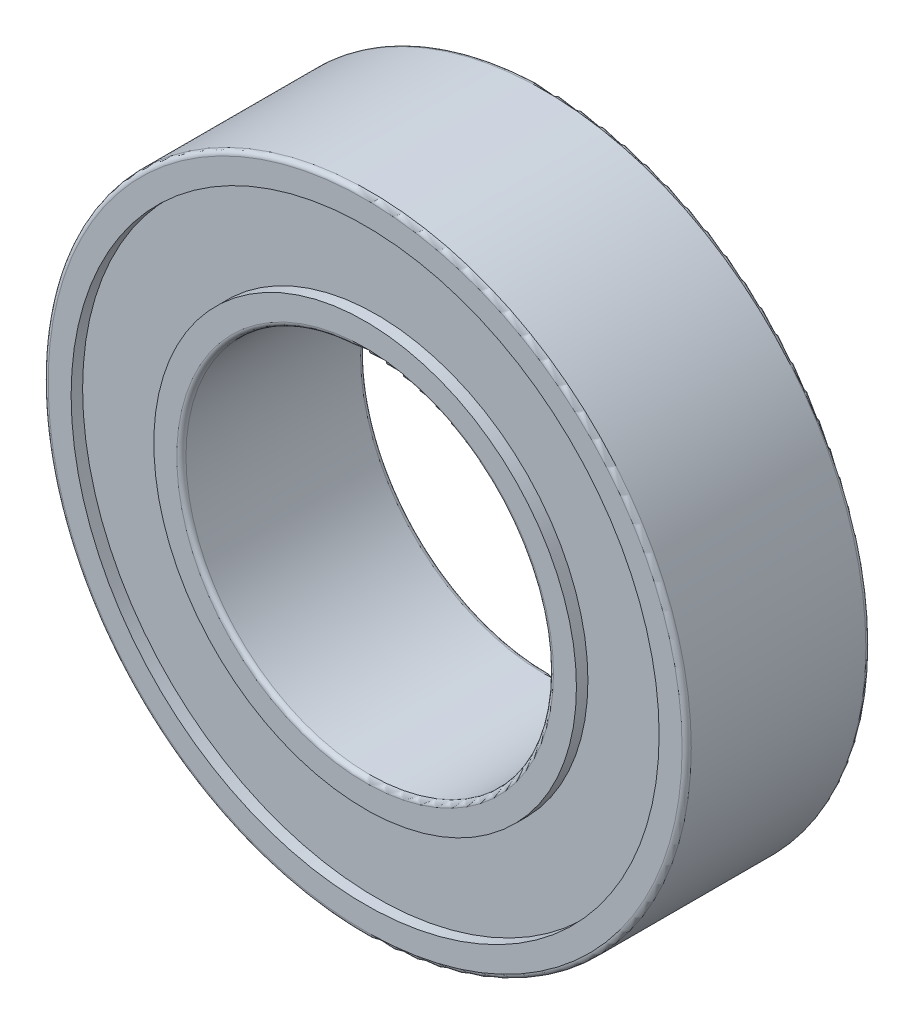
ISO-10303-21;
HEADER;
FILE_DESCRIPTION(('STEP AP214'),'2;1');
FILE_NAME('part.step','',(''),(''),'','','');
FILE_SCHEMA(('AUTOMOTIVE_DESIGN { 1 0 10303 214 1 1 1 1 }'));
ENDSEC;
DATA;
#1=APPLICATION_CONTEXT('core data for automotive mechanical design processes');
#2=APPLICATION_PROTOCOL_DEFINITION('international standard','automotive_design',2000,#1);
#3=PRODUCT_CONTEXT('',#1,'mechanical');
#4=PRODUCT('Part','Part','',(#3));
#5=PRODUCT_RELATED_PRODUCT_CATEGORY('part','',(#4));
#6=PRODUCT_DEFINITION_FORMATION('','',#4);
#7=PRODUCT_DEFINITION_CONTEXT('part definition',#1,'design');
#8=PRODUCT_DEFINITION('design','',#6,#7);
#9=PRODUCT_DEFINITION_SHAPE('','',#8);
#10=(LENGTH_UNIT() NAMED_UNIT(*) SI_UNIT(.MILLI.,.METRE.));
#11=(NAMED_UNIT(*) PLANE_ANGLE_UNIT() SI_UNIT($,.RADIAN.));
#12=(NAMED_UNIT(*) SI_UNIT($,.STERADIAN.) SOLID_ANGLE_UNIT());
#13=UNCERTAINTY_MEASURE_WITH_UNIT(LENGTH_MEASURE(1.E-05),#10,'distance_accuracy_value','');
#14=(GEOMETRIC_REPRESENTATION_CONTEXT(3) GLOBAL_UNCERTAINTY_ASSIGNED_CONTEXT((#13)) GLOBAL_UNIT_ASSIGNED_CONTEXT((#10,
#11,#12)) REPRESENTATION_CONTEXT('',''));
#15=CARTESIAN_POINT('',(0.,0.,0.));
#16=DIRECTION('',(0.,0.,1.));
#17=DIRECTION('',(1.,0.,0.));
#18=AXIS2_PLACEMENT_3D('',#15,#16,#17);
#19=CARTESIAN_POINT('',(0.,0.,0.));
#20=DIRECTION('',(0.,0.,1.));
#21=DIRECTION('',(1.,0.,0.));
#22=AXIS2_PLACEMENT_3D('',#19,#20,#21);
#23=PLANE('',#22);
#24=CARTESIAN_POINT('',(0.,0.,0.));
#25=DIRECTION('',(0.,0.,1.));
#26=DIRECTION('',(1.,0.,0.));
#27=AXIS2_PLACEMENT_3D('',#24,#25,#26);
#28=CIRCLE('',#27,4.1);
#29=CARTESIAN_POINT('',(4.1,0.,0.));
#30=VERTEX_POINT('',#29);
#31=EDGE_CURVE('E10',#30,#30,#28,.T.);
#32=ORIENTED_EDGE('',*,*,#31,.T.);
#33=EDGE_LOOP('',(#32));
#34=FACE_BOUND('',#33,.T.);
#35=CARTESIAN_POINT('',(0.,0.,0.));
#36=DIRECTION('',(0.,0.,-1.));
#37=DIRECTION('',(-1.,0.,0.));
#38=AXIS2_PLACEMENT_3D('',#35,#36,#37);
#39=CIRCLE('',#38,4.6);
#40=CARTESIAN_POINT('',(-4.6,0.,0.));
#41=VERTEX_POINT('',#40);
#42=EDGE_CURVE('E83',#41,#41,#39,.T.);
#43=ORIENTED_EDGE('',*,*,#42,.T.);
#44=EDGE_LOOP('',(#43));
#45=FACE_BOUND('',#44,.T.);
#46=ADVANCED_FACE('F32',(#34,#45),#23,.F.);
#47=CARTESIAN_POINT('',(0.,0.,4.));
#48=DIRECTION('',(0.,0.,1.));
#49=DIRECTION('',(1.,0.,0.));
#50=AXIS2_PLACEMENT_3D('',#47,#48,#49);
#51=PLANE('',#50);
#52=CARTESIAN_POINT('',(0.,0.,4.));
#53=DIRECTION('',(0.,0.,1.));
#54=DIRECTION('',(1.,0.,0.));
#55=AXIS2_PLACEMENT_3D('',#52,#53,#54);
#56=CIRCLE('',#55,4.1);
#57=CARTESIAN_POINT('',(4.1,0.,4.));
#58=VERTEX_POINT('',#57);
#59=EDGE_CURVE('E39',#58,#58,#56,.F.);
#60=ORIENTED_EDGE('',*,*,#59,.T.);
#61=EDGE_LOOP('',(#60));
#62=FACE_BOUND('',#61,.T.);
#63=CARTESIAN_POINT('',(0.,0.,4.));
#64=DIRECTION('',(0.,0.,1.));
#65=DIRECTION('',(1.,0.,0.));
#66=AXIS2_PLACEMENT_3D('',#63,#64,#65);
#67=CIRCLE('',#66,4.6);
#68=CARTESIAN_POINT('',(4.6,0.,4.));
#69=VERTEX_POINT('',#68);
#70=EDGE_CURVE('E71',#69,#69,#67,.T.);
#71=ORIENTED_EDGE('',*,*,#70,.T.);
#72=EDGE_LOOP('',(#71));
#73=FACE_BOUND('',#72,.T.);
#74=ADVANCED_FACE('F118',(#62,#73),#51,.T.);
#75=CARTESIAN_POINT('',(0.,0.,4.));
#76=DIRECTION('',(0.,0.,1.));
#77=DIRECTION('',(1.,0.,0.));
#78=AXIS2_PLACEMENT_3D('',#75,#76,#77);
#79=CIRCLE('',#78,6.9);
#80=CARTESIAN_POINT('',(6.9,0.,4.));
#81=VERTEX_POINT('',#80);
#82=EDGE_CURVE('E52',#81,#81,#79,.T.);
#83=ORIENTED_EDGE('',*,*,#82,.T.);
#84=EDGE_LOOP('',(#83));
#85=FACE_BOUND('',#84,.T.);
#86=CARTESIAN_POINT('',(0.,0.,4.));
#87=DIRECTION('',(0.,0.,1.));
#88=DIRECTION('',(1.,0.,0.));
#89=AXIS2_PLACEMENT_3D('',#86,#87,#88);
#90=CIRCLE('',#89,6.4);
#91=CARTESIAN_POINT('',(6.4,0.,4.));
#92=VERTEX_POINT('',#91);
#93=EDGE_CURVE('E65',#92,#92,#90,.T.);
#94=ORIENTED_EDGE('',*,*,#93,.F.);
#95=EDGE_LOOP('',(#94));
#96=FACE_BOUND('',#95,.T.);
#97=ADVANCED_FACE('F108',(#85,#96),#51,.T.);
#98=CARTESIAN_POINT('',(0.,0.,0.));
#99=DIRECTION('',(0.,0.,1.));
#100=DIRECTION('',(1.,0.,0.));
#101=AXIS2_PLACEMENT_3D('',#98,#99,#100);
#102=CIRCLE('',#101,6.9);
#103=CARTESIAN_POINT('',(6.9,0.,0.));
#104=VERTEX_POINT('',#103);
#105=EDGE_CURVE('E55',#104,#104,#102,.F.);
#106=ORIENTED_EDGE('',*,*,#105,.T.);
#107=EDGE_LOOP('',(#106));
#108=FACE_BOUND('',#107,.T.);
#109=CARTESIAN_POINT('',(0.,0.,0.));
#110=DIRECTION('',(0.,0.,-1.));
#111=DIRECTION('',(-1.,0.,0.));
#112=AXIS2_PLACEMENT_3D('',#109,#110,#111);
#113=CIRCLE('',#112,6.4);
#114=CARTESIAN_POINT('',(-6.4,0.,0.));
#115=VERTEX_POINT('',#114);
#116=EDGE_CURVE('E77',#115,#115,#113,.T.);
#117=ORIENTED_EDGE('',*,*,#116,.F.);
#118=EDGE_LOOP('',(#117));
#119=FACE_BOUND('',#118,.T.);
#120=ADVANCED_FACE('F105',(#108,#119),#23,.F.);
#121=CARTESIAN_POINT('',(0.,0.,4.));
#122=DIRECTION('',(0.,0.,-1.));
#123=DIRECTION('',(-1.,0.,0.));
#124=AXIS2_PLACEMENT_3D('',#121,#122,#123);
#125=CYLINDRICAL_SURFACE('',#124,7.);
#126=CARTESIAN_POINT('',(0.,0.,0.0999999999999998));
#127=DIRECTION('',(0.,0.,1.));
#128=DIRECTION('',(1.,0.,0.));
#129=AXIS2_PLACEMENT_3D('',#126,#127,#128);
#130=CIRCLE('',#129,7.);
#131=CARTESIAN_POINT('',(7.,0.,0.0999999999999998));
#132=VERTEX_POINT('',#131);
#133=EDGE_CURVE('E58',#132,#132,#130,.T.);
#134=ORIENTED_EDGE('',*,*,#133,.T.);
#135=EDGE_LOOP('',(#134));
#136=FACE_BOUND('',#135,.T.);
#137=CARTESIAN_POINT('',(0.,0.,3.9));
#138=DIRECTION('',(0.,0.,1.));
#139=DIRECTION('',(1.,0.,0.));
#140=AXIS2_PLACEMENT_3D('',#137,#138,#139);
#141=CIRCLE('',#140,7.);
#142=CARTESIAN_POINT('',(7.,0.,3.9));
#143=VERTEX_POINT('',#142);
#144=EDGE_CURVE('E61',#143,#143,#141,.F.);
#145=ORIENTED_EDGE('',*,*,#144,.T.);
#146=EDGE_LOOP('',(#145));
#147=FACE_BOUND('',#146,.T.);
#148=ADVANCED_FACE('F107',(#136,#147),#125,.T.);
#149=CARTESIAN_POINT('',(0.,0.,4.));
#150=DIRECTION('',(0.,0.,-1.));
#151=DIRECTION('',(-1.,0.,0.));
#152=AXIS2_PLACEMENT_3D('',#149,#150,#151);
#153=CYLINDRICAL_SURFACE('',#152,4.);
#154=CARTESIAN_POINT('',(0.,0.,3.9));
#155=DIRECTION('',(0.,0.,1.));
#156=DIRECTION('',(1.,0.,0.));
#157=AXIS2_PLACEMENT_3D('',#154,#155,#156);
#158=CIRCLE('',#157,4.);
#159=CARTESIAN_POINT('',(4.,0.,3.9));
#160=VERTEX_POINT('',#159);
#161=EDGE_CURVE('E43',#160,#160,#158,.T.);
#162=ORIENTED_EDGE('',*,*,#161,.T.);
#163=EDGE_LOOP('',(#162));
#164=FACE_BOUND('',#163,.T.);
#165=CARTESIAN_POINT('',(0.,0.,0.0999999999999998));
#166=DIRECTION('',(0.,0.,1.));
#167=DIRECTION('',(1.,0.,0.));
#168=AXIS2_PLACEMENT_3D('',#165,#166,#167);
#169=CIRCLE('',#168,4.);
#170=CARTESIAN_POINT('',(4.,0.,0.0999999999999998));
#171=VERTEX_POINT('',#170);
#172=EDGE_CURVE('E47',#171,#171,#169,.F.);
#173=ORIENTED_EDGE('',*,*,#172,.T.);
#174=EDGE_LOOP('',(#173));
#175=FACE_BOUND('',#174,.T.);
#176=ADVANCED_FACE('F115',(#164,#175),#153,.F.);
#177=CARTESIAN_POINT('',(0.,0.,3.75));
#178=DIRECTION('',(0.,0.,1.));
#179=DIRECTION('',(1.,0.,0.));
#180=AXIS2_PLACEMENT_3D('',#177,#178,#179);
#181=CYLINDRICAL_SURFACE('',#180,6.4);
#182=CARTESIAN_POINT('',(0.,0.,3.75));
#183=DIRECTION('',(0.,0.,1.));
#184=DIRECTION('',(1.,0.,0.));
#185=AXIS2_PLACEMENT_3D('',#182,#183,#184);
#186=CIRCLE('',#185,6.4);
#187=CARTESIAN_POINT('',(6.4,0.,3.75));
#188=VERTEX_POINT('',#187);
#189=EDGE_CURVE('E64',#188,#188,#186,.T.);
#190=ORIENTED_EDGE('',*,*,#189,.F.);
#191=EDGE_LOOP('',(#190));
#192=FACE_BOUND('',#191,.T.);
#193=ORIENTED_EDGE('',*,*,#93,.T.);
#194=EDGE_LOOP('',(#193));
#195=FACE_BOUND('',#194,.T.);
#196=ADVANCED_FACE('F143',(#192,#195),#181,.F.);
#197=CARTESIAN_POINT('',(0.,0.,3.75));
#198=DIRECTION('',(0.,0.,1.));
#199=DIRECTION('',(1.,0.,0.));
#200=AXIS2_PLACEMENT_3D('',#197,#198,#199);
#201=PLANE('',#200);
#202=CARTESIAN_POINT('',(0.,0.,3.75));
#203=DIRECTION('',(0.,0.,1.));
#204=DIRECTION('',(1.,0.,0.));
#205=AXIS2_PLACEMENT_3D('',#202,#203,#204);
#206=CIRCLE('',#205,4.6);
#207=CARTESIAN_POINT('',(4.6,0.,3.75));
#208=VERTEX_POINT('',#207);
#209=EDGE_CURVE('E68',#208,#208,#206,.T.);
#210=ORIENTED_EDGE('',*,*,#209,.F.);
#211=EDGE_LOOP('',(#210));
#212=FACE_BOUND('',#211,.T.);
#213=ORIENTED_EDGE('',*,*,#189,.T.);
#214=EDGE_LOOP('',(#213));
#215=FACE_BOUND('',#214,.T.);
#216=ADVANCED_FACE('F139',(#212,#215),#201,.T.);
#217=CARTESIAN_POINT('',(0.,0.,3.75));
#218=DIRECTION('',(0.,0.,1.));
#219=DIRECTION('',(1.,0.,0.));
#220=AXIS2_PLACEMENT_3D('',#217,#218,#219);
#221=CYLINDRICAL_SURFACE('',#220,4.6);
#222=ORIENTED_EDGE('',*,*,#209,.T.);
#223=EDGE_LOOP('',(#222));
#224=FACE_BOUND('',#223,.T.);
#225=ORIENTED_EDGE('',*,*,#70,.F.);
#226=EDGE_LOOP('',(#225));
#227=FACE_BOUND('',#226,.T.);
#228=ADVANCED_FACE('F101',(#224,#227),#221,.T.);
#229=CARTESIAN_POINT('',(0.,0.,0.25));
#230=DIRECTION('',(0.,0.,-1.));
#231=DIRECTION('',(-1.,0.,0.));
#232=AXIS2_PLACEMENT_3D('',#229,#230,#231);
#233=CYLINDRICAL_SURFACE('',#232,6.4);
#234=CARTESIAN_POINT('',(0.,0.,0.25));
#235=DIRECTION('',(0.,0.,-1.));
#236=DIRECTION('',(-1.,0.,0.));
#237=AXIS2_PLACEMENT_3D('',#234,#235,#236);
#238=CIRCLE('',#237,6.4);
#239=CARTESIAN_POINT('',(-6.4,0.,0.25));
#240=VERTEX_POINT('',#239);
#241=EDGE_CURVE('E74',#240,#240,#238,.T.);
#242=ORIENTED_EDGE('',*,*,#241,.F.);
#243=EDGE_LOOP('',(#242));
#244=FACE_BOUND('',#243,.T.);
#245=ORIENTED_EDGE('',*,*,#116,.T.);
#246=EDGE_LOOP('',(#245));
#247=FACE_BOUND('',#246,.T.);
#248=ADVANCED_FACE('F95',(#244,#247),#233,.F.);
#249=CARTESIAN_POINT('',(0.,0.,0.25));
#250=DIRECTION('',(0.,0.,-1.));
#251=DIRECTION('',(-1.,0.,0.));
#252=AXIS2_PLACEMENT_3D('',#249,#250,#251);
#253=PLANE('',#252);
#254=CARTESIAN_POINT('',(0.,0.,0.25));
#255=DIRECTION('',(0.,0.,-1.));
#256=DIRECTION('',(-1.,0.,0.));
#257=AXIS2_PLACEMENT_3D('',#254,#255,#256);
#258=CIRCLE('',#257,4.6);
#259=CARTESIAN_POINT('',(-4.6,0.,0.25));
#260=VERTEX_POINT('',#259);
#261=EDGE_CURVE('E80',#260,#260,#258,.T.);
#262=ORIENTED_EDGE('',*,*,#261,.F.);
#263=EDGE_LOOP('',(#262));
#264=FACE_BOUND('',#263,.T.);
#265=ORIENTED_EDGE('',*,*,#241,.T.);
#266=EDGE_LOOP('',(#265));
#267=FACE_BOUND('',#266,.T.);
#268=ADVANCED_FACE('F92',(#264,#267),#253,.T.);
#269=CARTESIAN_POINT('',(0.,0.,0.25));
#270=DIRECTION('',(0.,0.,-1.));
#271=DIRECTION('',(-1.,0.,0.));
#272=AXIS2_PLACEMENT_3D('',#269,#270,#271);
#273=CYLINDRICAL_SURFACE('',#272,4.6);
#274=ORIENTED_EDGE('',*,*,#261,.T.);
#275=EDGE_LOOP('',(#274));
#276=FACE_BOUND('',#275,.T.);
#277=ORIENTED_EDGE('',*,*,#42,.F.);
#278=EDGE_LOOP('',(#277));
#279=FACE_BOUND('',#278,.T.);
#280=ADVANCED_FACE('F89',(#276,#279),#273,.T.);
#281=CARTESIAN_POINT('',(0.,0.,0.0999999999999998));
#282=DIRECTION('',(0.,0.,1.));
#283=DIRECTION('',(1.,0.,0.));
#284=AXIS2_PLACEMENT_3D('',#281,#282,#283);
#285=TOROIDAL_SURFACE('',#284,6.9,0.1);
#286=ORIENTED_EDGE('',*,*,#105,.F.);
#287=EDGE_LOOP('',(#286));
#288=FACE_BOUND('',#287,.T.);
#289=ORIENTED_EDGE('',*,*,#133,.F.);
#290=EDGE_LOOP('',(#289));
#291=FACE_BOUND('',#290,.T.);
#292=ADVANCED_FACE('F128',(#288,#291),#285,.T.);
#293=CARTESIAN_POINT('',(0.,0.,3.9));
#294=DIRECTION('',(0.,0.,1.));
#295=DIRECTION('',(1.,0.,0.));
#296=AXIS2_PLACEMENT_3D('',#293,#294,#295);
#297=TOROIDAL_SURFACE('',#296,6.9,0.1);
#298=ORIENTED_EDGE('',*,*,#144,.F.);
#299=EDGE_LOOP('',(#298));
#300=FACE_BOUND('',#299,.T.);
#301=ORIENTED_EDGE('',*,*,#82,.F.);
#302=EDGE_LOOP('',(#301));
#303=FACE_BOUND('',#302,.T.);
#304=ADVANCED_FACE('F133',(#300,#303),#297,.T.);
#305=CARTESIAN_POINT('',(0.,0.,3.9));
#306=DIRECTION('',(0.,0.,1.));
#307=DIRECTION('',(1.,0.,0.));
#308=AXIS2_PLACEMENT_3D('',#305,#306,#307);
#309=TOROIDAL_SURFACE('',#308,4.1,0.1);
#310=ORIENTED_EDGE('',*,*,#59,.F.);
#311=EDGE_LOOP('',(#310));
#312=FACE_BOUND('',#311,.T.);
#313=ORIENTED_EDGE('',*,*,#161,.F.);
#314=EDGE_LOOP('',(#313));
#315=FACE_BOUND('',#314,.T.);
#316=ADVANCED_FACE('F158',(#312,#315),#309,.T.);
#317=CARTESIAN_POINT('',(0.,0.,0.0999999999999998));
#318=DIRECTION('',(0.,0.,1.));
#319=DIRECTION('',(1.,0.,0.));
#320=AXIS2_PLACEMENT_3D('',#317,#318,#319);
#321=TOROIDAL_SURFACE('',#320,4.1,0.1);
#322=ORIENTED_EDGE('',*,*,#172,.F.);
#323=EDGE_LOOP('',(#322));
#324=FACE_BOUND('',#323,.T.);
#325=ORIENTED_EDGE('',*,*,#31,.F.);
#326=EDGE_LOOP('',(#325));
#327=FACE_BOUND('',#326,.T.);
#328=ADVANCED_FACE('F34',(#324,#327),#321,.T.);
#329=CLOSED_SHELL('',(#46,#74,#97,#120,#148,#176,#196,#216,#228,#248,#268,#280,#292,#304,#316,#328));
#330=MANIFOLD_SOLID_BREP('B2',#329);
#331=ADVANCED_BREP_SHAPE_REPRESENTATION('',(#18,#330),#14);
#332=SHAPE_DEFINITION_REPRESENTATION(#9,#331);
ENDSEC;
END-ISO-10303-21;
